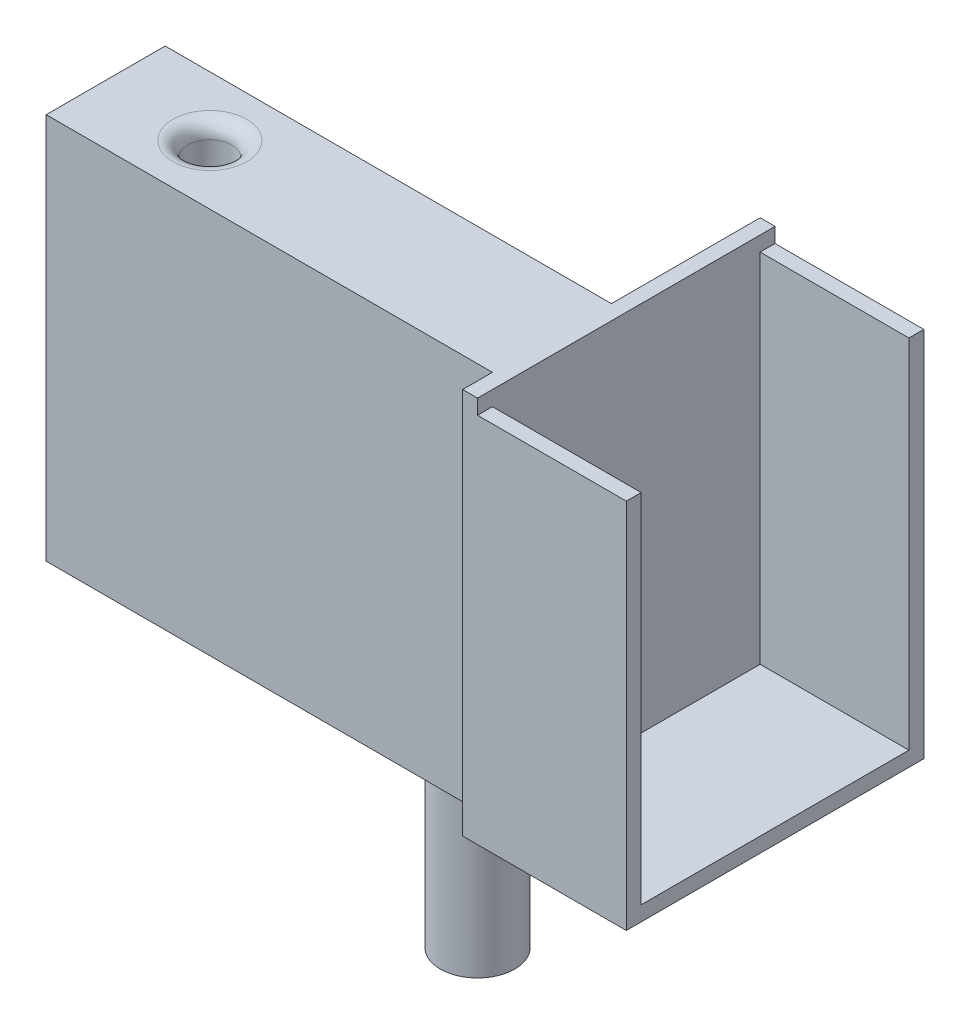
ISO-10303-21;
HEADER;
FILE_DESCRIPTION(('STEP AP214'),'2;1');
FILE_NAME('part.step','',(''),(''),'','','');
FILE_SCHEMA(('AUTOMOTIVE_DESIGN { 1 0 10303 214 1 1 1 1 }'));
ENDSEC;
DATA;
#1=APPLICATION_CONTEXT('core data for automotive mechanical design processes');
#2=APPLICATION_PROTOCOL_DEFINITION('international standard','automotive_design',2000,#1);
#3=PRODUCT_CONTEXT('',#1,'mechanical');
#4=PRODUCT('Part','Part','',(#3));
#5=PRODUCT_RELATED_PRODUCT_CATEGORY('part','',(#4));
#6=PRODUCT_DEFINITION_FORMATION('','',#4);
#7=PRODUCT_DEFINITION_CONTEXT('part definition',#1,'design');
#8=PRODUCT_DEFINITION('design','',#6,#7);
#9=PRODUCT_DEFINITION_SHAPE('','',#8);
#10=(LENGTH_UNIT() NAMED_UNIT(*) SI_UNIT(.MILLI.,.METRE.));
#11=(NAMED_UNIT(*) PLANE_ANGLE_UNIT() SI_UNIT($,.RADIAN.));
#12=(NAMED_UNIT(*) SI_UNIT($,.STERADIAN.) SOLID_ANGLE_UNIT());
#13=UNCERTAINTY_MEASURE_WITH_UNIT(LENGTH_MEASURE(1.E-05),#10,'distance_accuracy_value','');
#14=(GEOMETRIC_REPRESENTATION_CONTEXT(3) GLOBAL_UNCERTAINTY_ASSIGNED_CONTEXT((#13)) GLOBAL_UNIT_ASSIGNED_CONTEXT((#10,
#11,#12)) REPRESENTATION_CONTEXT('',''));
#15=CARTESIAN_POINT('',(0.,0.,0.));
#16=DIRECTION('',(0.,0.,1.));
#17=DIRECTION('',(1.,0.,0.));
#18=AXIS2_PLACEMENT_3D('',#15,#16,#17);
#19=CARTESIAN_POINT('',(0.,0.,20.32));
#20=DIRECTION('',(0.,1.,0.));
#21=DIRECTION('',(0.,0.,1.));
#22=AXIS2_PLACEMENT_3D('',#19,#20,#21);
#23=PLANE('',#22);
#24=DIRECTION('',(1.,0.,0.));
#25=VECTOR('',#24,1.);
#26=CARTESIAN_POINT('',(0.,0.,0.));
#27=LINE('',#26,#25);
#28=CARTESIAN_POINT('',(0.,0.,0.));
#29=VERTEX_POINT('',#28);
#30=CARTESIAN_POINT('',(76.2,0.,0.));
#31=VERTEX_POINT('',#30);
#32=EDGE_CURVE('E398',#29,#31,#27,.T.);
#33=ORIENTED_EDGE('',*,*,#32,.T.);
#34=DIRECTION('',(0.,0.,-1.));
#35=VECTOR('',#34,1.);
#36=CARTESIAN_POINT('',(76.2,0.,25.4));
#37=LINE('',#36,#35);
#38=CARTESIAN_POINT('',(76.2,0.,-25.4));
#39=VERTEX_POINT('',#38);
#40=EDGE_CURVE('E313',#31,#39,#37,.T.);
#41=ORIENTED_EDGE('',*,*,#40,.T.);
#42=DIRECTION('',(-1.,0.,0.));
#43=VECTOR('',#42,1.);
#44=CARTESIAN_POINT('',(78.74,0.,-25.4));
#45=LINE('',#44,#43);
#46=CARTESIAN_POINT('',(104.14,0.,-25.4));
#47=VERTEX_POINT('',#46);
#48=EDGE_CURVE('E340',#47,#39,#45,.T.);
#49=ORIENTED_EDGE('',*,*,#48,.F.);
#50=DIRECTION('',(0.,0.,-1.));
#51=VECTOR('',#50,1.);
#52=CARTESIAN_POINT('',(104.14,0.,25.4));
#53=LINE('',#52,#51);
#54=CARTESIAN_POINT('',(104.14,0.,25.4));
#55=VERTEX_POINT('',#54);
#56=EDGE_CURVE('E234',#55,#47,#53,.T.);
#57=ORIENTED_EDGE('',*,*,#56,.F.);
#58=DIRECTION('',(-1.,0.,0.));
#59=VECTOR('',#58,1.);
#60=CARTESIAN_POINT('',(78.74,0.,25.4));
#61=LINE('',#60,#59);
#62=CARTESIAN_POINT('',(76.2,0.,25.4));
#63=VERTEX_POINT('',#62);
#64=EDGE_CURVE('E342',#55,#63,#61,.T.);
#65=ORIENTED_EDGE('',*,*,#64,.T.);
#66=CARTESIAN_POINT('',(76.2,0.,20.32));
#67=VERTEX_POINT('',#66);
#68=EDGE_CURVE('E317',#63,#67,#37,.T.);
#69=ORIENTED_EDGE('',*,*,#68,.T.);
#70=DIRECTION('',(1.,0.,0.));
#71=VECTOR('',#70,1.);
#72=CARTESIAN_POINT('',(0.,0.,20.32));
#73=LINE('',#72,#71);
#74=CARTESIAN_POINT('',(0.,0.,20.32));
#75=VERTEX_POINT('',#74);
#76=EDGE_CURVE('E378',#75,#67,#73,.T.);
#77=ORIENTED_EDGE('',*,*,#76,.F.);
#78=DIRECTION('',(0.,0.,-1.));
#79=VECTOR('',#78,1.);
#80=CARTESIAN_POINT('',(0.,0.,20.32));
#81=LINE('',#80,#79);
#82=EDGE_CURVE('E408',#75,#29,#81,.T.);
#83=ORIENTED_EDGE('',*,*,#82,.T.);
#84=EDGE_LOOP('',(#33,#41,#49,#57,#65,#69,#77,#83));
#85=FACE_BOUND('',#84,.T.);
#86=DIRECTION('',(1.,0.,0.));
#87=VECTOR('',#86,1.);
#88=CARTESIAN_POINT('',(6.16,0.,6.16));
#89=LINE('',#88,#87);
#90=CARTESIAN_POINT('',(6.16,0.,6.16));
#91=VERTEX_POINT('',#90);
#92=CARTESIAN_POINT('',(14.16,0.,6.16));
#93=VERTEX_POINT('',#92);
#94=EDGE_CURVE('E347',#91,#93,#89,.T.);
#95=ORIENTED_EDGE('',*,*,#94,.F.);
#96=DIRECTION('',(0.,0.,-1.));
#97=VECTOR('',#96,1.);
#98=CARTESIAN_POINT('',(6.16,0.,14.16));
#99=LINE('',#98,#97);
#100=CARTESIAN_POINT('',(6.16,0.,14.16));
#101=VERTEX_POINT('',#100);
#102=EDGE_CURVE('E344',#101,#91,#99,.T.);
#103=ORIENTED_EDGE('',*,*,#102,.F.);
#104=DIRECTION('',(1.,0.,0.));
#105=VECTOR('',#104,1.);
#106=CARTESIAN_POINT('',(6.16,0.,14.16));
#107=LINE('',#106,#105);
#108=CARTESIAN_POINT('',(14.16,0.,14.16));
#109=VERTEX_POINT('',#108);
#110=EDGE_CURVE('E362',#101,#109,#107,.T.);
#111=ORIENTED_EDGE('',*,*,#110,.T.);
#112=DIRECTION('',(0.,0.,-1.));
#113=VECTOR('',#112,1.);
#114=CARTESIAN_POINT('',(14.16,0.,14.16));
#115=LINE('',#114,#113);
#116=EDGE_CURVE('E354',#109,#93,#115,.T.);
#117=ORIENTED_EDGE('',*,*,#116,.T.);
#118=EDGE_LOOP('',(#95,#103,#111,#117));
#119=FACE_BOUND('',#118,.T.);
#120=CARTESIAN_POINT('',(63.5,0.,10.16));
#121=DIRECTION('',(0.,1.,0.));
#122=DIRECTION('',(0.,0.,1.));
#123=AXIS2_PLACEMENT_3D('',#120,#121,#122);
#124=CIRCLE('',#123,6.35);
#125=CARTESIAN_POINT('',(63.5,0.,16.51));
#126=VERTEX_POINT('',#125);
#127=EDGE_CURVE('E11',#126,#126,#124,.F.);
#128=ORIENTED_EDGE('',*,*,#127,.F.);
#129=EDGE_LOOP('',(#128));
#130=FACE_BOUND('',#129,.T.);
#131=ADVANCED_FACE('F33',(#85,#119,#130),#23,.F.);
#132=CARTESIAN_POINT('',(17.78,8.89,10.16));
#133=DIRECTION('',(0.,1.,0.));
#134=DIRECTION('',(0.,0.,1.));
#135=AXIS2_PLACEMENT_3D('',#132,#133,#134);
#136=CYLINDRICAL_SURFACE('',#135,3.74999999299999);
#137=CARTESIAN_POINT('',(17.78,63.5,10.16));
#138=DIRECTION('',(0.,-1.,0.));
#139=DIRECTION('',(0.,0.,-1.));
#140=AXIS2_PLACEMENT_3D('',#137,#138,#139);
#141=CIRCLE('',#140,3.74999999299999);
#142=CARTESIAN_POINT('',(17.78,63.5,6.410000007));
#143=VERTEX_POINT('',#142);
#144=EDGE_CURVE('E410',#143,#143,#141,.F.);
#145=ORIENTED_EDGE('',*,*,#144,.T.);
#146=EDGE_LOOP('',(#145));
#147=FACE_BOUND('',#146,.T.);
#148=CARTESIAN_POINT('',(17.78,12.08,10.16));
#149=DIRECTION('',(0.,-1.,0.));
#150=DIRECTION('',(0.,0.,-1.));
#151=AXIS2_PLACEMENT_3D('',#148,#149,#150);
#152=CIRCLE('',#151,3.74999999299999);
#153=CARTESIAN_POINT('',(17.78,12.08,6.410000007));
#154=VERTEX_POINT('',#153);
#155=EDGE_CURVE('E227',#154,#154,#152,.F.);
#156=ORIENTED_EDGE('',*,*,#155,.F.);
#157=EDGE_LOOP('',(#156));
#158=FACE_BOUND('',#157,.T.);
#159=ADVANCED_FACE('F436',(#147,#158),#136,.F.);
#160=CARTESIAN_POINT('',(78.74,0.,0.));
#161=DIRECTION('',(1.,0.,0.));
#162=DIRECTION('',(0.,0.,-1.));
#163=AXIS2_PLACEMENT_3D('',#160,#161,#162);
#164=PLANE('',#163);
#165=DIRECTION('',(0.,0.,1.));
#166=VECTOR('',#165,1.);
#167=CARTESIAN_POINT('',(78.74,63.5,25.4));
#168=LINE('',#167,#166);
#169=CARTESIAN_POINT('',(78.74,63.5,22.86));
#170=VERTEX_POINT('',#169);
#171=CARTESIAN_POINT('',(78.74,63.5,25.4));
#172=VERTEX_POINT('',#171);
#173=EDGE_CURVE('E56',#170,#172,#168,.T.);
#174=ORIENTED_EDGE('',*,*,#173,.F.);
#175=DIRECTION('',(0.,1.,0.));
#176=VECTOR('',#175,1.);
#177=CARTESIAN_POINT('',(78.74,2.53999999999999,22.86));
#178=LINE('',#177,#176);
#179=CARTESIAN_POINT('',(78.74,2.53999999999999,22.86));
#180=VERTEX_POINT('',#179);
#181=EDGE_CURVE('E256',#180,#170,#178,.T.);
#182=ORIENTED_EDGE('',*,*,#181,.F.);
#183=DIRECTION('',(0.,0.,1.));
#184=VECTOR('',#183,1.);
#185=CARTESIAN_POINT('',(78.74,2.53999999999999,22.86));
#186=LINE('',#185,#184);
#187=CARTESIAN_POINT('',(78.74,2.53999999999999,-22.86));
#188=VERTEX_POINT('',#187);
#189=EDGE_CURVE('E253',#188,#180,#186,.T.);
#190=ORIENTED_EDGE('',*,*,#189,.F.);
#191=DIRECTION('',(0.,-1.,0.));
#192=VECTOR('',#191,1.);
#193=CARTESIAN_POINT('',(78.74,2.53999999999999,-22.86));
#194=LINE('',#193,#192);
#195=CARTESIAN_POINT('',(78.74,63.5,-22.86));
#196=VERTEX_POINT('',#195);
#197=EDGE_CURVE('E250',#196,#188,#194,.T.);
#198=ORIENTED_EDGE('',*,*,#197,.F.);
#199=DIRECTION('',(0.,0.,1.));
#200=VECTOR('',#199,1.);
#201=CARTESIAN_POINT('',(78.74,63.5,-25.4));
#202=LINE('',#201,#200);
#203=CARTESIAN_POINT('',(78.74,63.5,-25.4));
#204=VERTEX_POINT('',#203);
#205=EDGE_CURVE('E230',#204,#196,#202,.T.);
#206=ORIENTED_EDGE('',*,*,#205,.F.);
#207=DIRECTION('',(0.,1.,0.));
#208=VECTOR('',#207,1.);
#209=CARTESIAN_POINT('',(78.74,66.04,-25.4));
#210=LINE('',#209,#208);
#211=CARTESIAN_POINT('',(78.74,66.04,-25.4));
#212=VERTEX_POINT('',#211);
#213=EDGE_CURVE('E298',#204,#212,#210,.T.);
#214=ORIENTED_EDGE('',*,*,#213,.T.);
#215=DIRECTION('',(0.,0.,1.));
#216=VECTOR('',#215,1.);
#217=CARTESIAN_POINT('',(78.74,66.04,25.4));
#218=LINE('',#217,#216);
#219=CARTESIAN_POINT('',(78.74,66.04,25.4));
#220=VERTEX_POINT('',#219);
#221=EDGE_CURVE('E303',#212,#220,#218,.T.);
#222=ORIENTED_EDGE('',*,*,#221,.T.);
#223=DIRECTION('',(0.,-1.,0.));
#224=VECTOR('',#223,1.);
#225=CARTESIAN_POINT('',(78.74,66.04,25.4));
#226=LINE('',#225,#224);
#227=EDGE_CURVE('E295',#220,#172,#226,.T.);
#228=ORIENTED_EDGE('',*,*,#227,.T.);
#229=EDGE_LOOP('',(#174,#182,#190,#198,#206,#214,#222,#228));
#230=FACE_BOUND('',#229,.T.);
#231=DIRECTION('',(0.,0.,1.));
#232=VECTOR('',#231,1.);
#233=CARTESIAN_POINT('',(78.74,12.08,3.16));
#234=LINE('',#233,#232);
#235=CARTESIAN_POINT('',(78.74,12.08,3.16));
#236=VERTEX_POINT('',#235);
#237=CARTESIAN_POINT('',(78.74,12.08,17.16));
#238=VERTEX_POINT('',#237);
#239=EDGE_CURVE('E218',#236,#238,#234,.T.);
#240=ORIENTED_EDGE('',*,*,#239,.F.);
#241=DIRECTION('',(0.,1.,0.));
#242=VECTOR('',#241,1.);
#243=CARTESIAN_POINT('',(78.74,5.08000000000001,3.16));
#244=LINE('',#243,#242);
#245=CARTESIAN_POINT('',(78.74,5.08000000000001,3.16));
#246=VERTEX_POINT('',#245);
#247=EDGE_CURVE('E189',#246,#236,#244,.T.);
#248=ORIENTED_EDGE('',*,*,#247,.F.);
#249=DIRECTION('',(0.,0.,1.));
#250=VECTOR('',#249,1.);
#251=CARTESIAN_POINT('',(78.74,5.08000000000001,3.16));
#252=LINE('',#251,#250);
#253=CARTESIAN_POINT('',(78.74,5.08000000000001,17.16));
#254=VERTEX_POINT('',#253);
#255=EDGE_CURVE('E192',#246,#254,#252,.T.);
#256=ORIENTED_EDGE('',*,*,#255,.T.);
#257=DIRECTION('',(0.,1.,0.));
#258=VECTOR('',#257,1.);
#259=CARTESIAN_POINT('',(78.74,5.08000000000001,17.16));
#260=LINE('',#259,#258);
#261=EDGE_CURVE('E215',#254,#238,#260,.T.);
#262=ORIENTED_EDGE('',*,*,#261,.T.);
#263=EDGE_LOOP('',(#240,#248,#256,#262));
#264=FACE_BOUND('',#263,.T.);
#265=ADVANCED_FACE('F441',(#230,#264),#164,.T.);
#266=CARTESIAN_POINT('',(0.,0.,20.32));
#267=DIRECTION('',(1.,0.,0.));
#268=DIRECTION('',(0.,0.,-1.));
#269=AXIS2_PLACEMENT_3D('',#266,#267,#268);
#270=PLANE('',#269);
#271=DIRECTION('',(0.,-1.,0.));
#272=VECTOR('',#271,1.);
#273=CARTESIAN_POINT('',(0.,0.,0.));
#274=LINE('',#273,#272);
#275=CARTESIAN_POINT('',(0.,66.04,0.));
#276=VERTEX_POINT('',#275);
#277=EDGE_CURVE('E368',#276,#29,#274,.T.);
#278=ORIENTED_EDGE('',*,*,#277,.T.);
#279=ORIENTED_EDGE('',*,*,#82,.F.);
#280=DIRECTION('',(0.,-1.,0.));
#281=VECTOR('',#280,1.);
#282=CARTESIAN_POINT('',(0.,0.,20.32));
#283=LINE('',#282,#281);
#284=CARTESIAN_POINT('',(0.,66.04,20.32));
#285=VERTEX_POINT('',#284);
#286=EDGE_CURVE('E375',#285,#75,#283,.T.);
#287=ORIENTED_EDGE('',*,*,#286,.F.);
#288=DIRECTION('',(0.,0.,-1.));
#289=VECTOR('',#288,1.);
#290=CARTESIAN_POINT('',(0.,66.04,20.32));
#291=LINE('',#290,#289);
#292=EDGE_CURVE('E391',#285,#276,#291,.T.);
#293=ORIENTED_EDGE('',*,*,#292,.T.);
#294=EDGE_LOOP('',(#278,#279,#287,#293));
#295=FACE_BOUND('',#294,.T.);
#296=ADVANCED_FACE('F446',(#295),#270,.F.);
#297=CARTESIAN_POINT('',(0.,66.04,20.32));
#298=DIRECTION('',(0.,-1.,0.));
#299=DIRECTION('',(0.,0.,-1.));
#300=AXIS2_PLACEMENT_3D('',#297,#298,#299);
#301=PLANE('',#300);
#302=CARTESIAN_POINT('',(17.78,66.04,10.16));
#303=DIRECTION('',(0.,-1.,0.));
#304=DIRECTION('',(0.,0.,-1.));
#305=AXIS2_PLACEMENT_3D('',#302,#303,#304);
#306=CIRCLE('',#305,6.28999999299999);
#307=CARTESIAN_POINT('',(17.78,66.04,3.87000000700001));
#308=VERTEX_POINT('',#307);
#309=EDGE_CURVE('E41',#308,#308,#306,.T.);
#310=ORIENTED_EDGE('',*,*,#309,.T.);
#311=EDGE_LOOP('',(#310));
#312=FACE_BOUND('',#311,.T.);
#313=DIRECTION('',(-1.,0.,0.));
#314=VECTOR('',#313,1.);
#315=CARTESIAN_POINT('',(0.,66.04,0.));
#316=LINE('',#315,#314);
#317=CARTESIAN_POINT('',(76.2,66.04,0.));
#318=VERTEX_POINT('',#317);
#319=EDGE_CURVE('E379',#318,#276,#316,.T.);
#320=ORIENTED_EDGE('',*,*,#319,.T.);
#321=ORIENTED_EDGE('',*,*,#292,.F.);
#322=DIRECTION('',(-1.,0.,0.));
#323=VECTOR('',#322,1.);
#324=CARTESIAN_POINT('',(0.,66.04,20.32));
#325=LINE('',#324,#323);
#326=CARTESIAN_POINT('',(76.2,66.04,20.32));
#327=VERTEX_POINT('',#326);
#328=EDGE_CURVE('E388',#327,#285,#325,.T.);
#329=ORIENTED_EDGE('',*,*,#328,.F.);
#330=DIRECTION('',(0.,0.,1.));
#331=VECTOR('',#330,1.);
#332=CARTESIAN_POINT('',(76.2,66.04,25.4));
#333=LINE('',#332,#331);
#334=CARTESIAN_POINT('',(76.2,66.04,25.4));
#335=VERTEX_POINT('',#334);
#336=EDGE_CURVE('E329',#327,#335,#333,.T.);
#337=ORIENTED_EDGE('',*,*,#336,.T.);
#338=DIRECTION('',(-1.,0.,0.));
#339=VECTOR('',#338,1.);
#340=CARTESIAN_POINT('',(78.74,66.04,25.4));
#341=LINE('',#340,#339);
#342=EDGE_CURVE('E334',#220,#335,#341,.T.);
#343=ORIENTED_EDGE('',*,*,#342,.F.);
#344=ORIENTED_EDGE('',*,*,#221,.F.);
#345=DIRECTION('',(-1.,0.,0.));
#346=VECTOR('',#345,1.);
#347=CARTESIAN_POINT('',(78.74,66.04,-25.4));
#348=LINE('',#347,#346);
#349=CARTESIAN_POINT('',(76.2,66.04,-25.4));
#350=VERTEX_POINT('',#349);
#351=EDGE_CURVE('E337',#212,#350,#348,.T.);
#352=ORIENTED_EDGE('',*,*,#351,.T.);
#353=EDGE_CURVE('E299',#350,#318,#333,.T.);
#354=ORIENTED_EDGE('',*,*,#353,.T.);
#355=EDGE_LOOP('',(#320,#321,#329,#337,#343,#344,#352,#354));
#356=FACE_BOUND('',#355,.T.);
#357=ADVANCED_FACE('F417',(#312,#356),#301,.F.);
#358=CARTESIAN_POINT('',(0.,0.,20.32));
#359=DIRECTION('',(0.,0.,-1.));
#360=DIRECTION('',(-1.,0.,0.));
#361=AXIS2_PLACEMENT_3D('',#358,#359,#360);
#362=PLANE('',#361);
#363=ORIENTED_EDGE('',*,*,#286,.T.);
#364=ORIENTED_EDGE('',*,*,#76,.T.);
#365=DIRECTION('',(0.,1.,0.));
#366=VECTOR('',#365,1.);
#367=CARTESIAN_POINT('',(76.2,0.,20.32));
#368=LINE('',#367,#366);
#369=EDGE_CURVE('E384',#67,#327,#368,.T.);
#370=ORIENTED_EDGE('',*,*,#369,.T.);
#371=ORIENTED_EDGE('',*,*,#328,.T.);
#372=EDGE_LOOP('',(#363,#364,#370,#371));
#373=FACE_BOUND('',#372,.T.);
#374=ADVANCED_FACE('F453',(#373),#362,.F.);
#375=CARTESIAN_POINT('',(0.,0.,0.));
#376=DIRECTION('',(0.,0.,-1.));
#377=DIRECTION('',(-1.,0.,0.));
#378=AXIS2_PLACEMENT_3D('',#375,#376,#377);
#379=PLANE('',#378);
#380=ORIENTED_EDGE('',*,*,#277,.F.);
#381=ORIENTED_EDGE('',*,*,#319,.F.);
#382=DIRECTION('',(0.,1.,0.));
#383=VECTOR('',#382,1.);
#384=CARTESIAN_POINT('',(76.2,0.,0.));
#385=LINE('',#384,#383);
#386=EDGE_CURVE('E401',#31,#318,#385,.T.);
#387=ORIENTED_EDGE('',*,*,#386,.F.);
#388=ORIENTED_EDGE('',*,*,#32,.F.);
#389=EDGE_LOOP('',(#380,#381,#387,#388));
#390=FACE_BOUND('',#389,.T.);
#391=ADVANCED_FACE('F462',(#390),#379,.T.);
#392=CARTESIAN_POINT('',(6.16,5.08,14.16));
#393=DIRECTION('',(-1.,0.,0.));
#394=DIRECTION('',(0.,0.,1.));
#395=AXIS2_PLACEMENT_3D('',#392,#393,#394);
#396=PLANE('',#395);
#397=ORIENTED_EDGE('',*,*,#102,.T.);
#398=DIRECTION('',(0.,-1.,0.));
#399=VECTOR('',#398,1.);
#400=CARTESIAN_POINT('',(6.16,5.08,6.16));
#401=LINE('',#400,#399);
#402=CARTESIAN_POINT('',(6.16,5.08,6.16));
#403=VERTEX_POINT('',#402);
#404=EDGE_CURVE('E373',#403,#91,#401,.T.);
#405=ORIENTED_EDGE('',*,*,#404,.F.);
#406=DIRECTION('',(0.,0.,-1.));
#407=VECTOR('',#406,1.);
#408=CARTESIAN_POINT('',(6.16,5.08,14.16));
#409=LINE('',#408,#407);
#410=CARTESIAN_POINT('',(6.16,5.08000000000001,14.16));
#411=VERTEX_POINT('',#410);
#412=EDGE_CURVE('E365',#411,#403,#409,.T.);
#413=ORIENTED_EDGE('',*,*,#412,.F.);
#414=DIRECTION('',(0.,-1.,0.));
#415=VECTOR('',#414,1.);
#416=CARTESIAN_POINT('',(6.16,5.08,14.16));
#417=LINE('',#416,#415);
#418=EDGE_CURVE('E366',#411,#101,#417,.T.);
#419=ORIENTED_EDGE('',*,*,#418,.T.);
#420=EDGE_LOOP('',(#397,#405,#413,#419));
#421=FACE_BOUND('',#420,.T.);
#422=ADVANCED_FACE('F488',(#421),#396,.F.);
#423=CARTESIAN_POINT('',(6.16,5.08,14.16));
#424=DIRECTION('',(0.,0.,-1.));
#425=DIRECTION('',(-1.,0.,0.));
#426=AXIS2_PLACEMENT_3D('',#423,#424,#425);
#427=PLANE('',#426);
#428=ORIENTED_EDGE('',*,*,#110,.F.);
#429=ORIENTED_EDGE('',*,*,#418,.F.);
#430=DIRECTION('',(1.,0.,0.));
#431=VECTOR('',#430,1.);
#432=CARTESIAN_POINT('',(6.16,5.08,14.16));
#433=LINE('',#432,#431);
#434=CARTESIAN_POINT('',(14.16,5.08000000000001,14.16));
#435=VERTEX_POINT('',#434);
#436=EDGE_CURVE('E357',#411,#435,#433,.T.);
#437=ORIENTED_EDGE('',*,*,#436,.T.);
#438=DIRECTION('',(0.,-1.,0.));
#439=VECTOR('',#438,1.);
#440=CARTESIAN_POINT('',(14.16,5.08,14.16));
#441=LINE('',#440,#439);
#442=EDGE_CURVE('E369',#435,#109,#441,.T.);
#443=ORIENTED_EDGE('',*,*,#442,.T.);
#444=EDGE_LOOP('',(#428,#429,#437,#443));
#445=FACE_BOUND('',#444,.T.);
#446=ADVANCED_FACE('F485',(#445),#427,.T.);
#447=CARTESIAN_POINT('',(14.16,5.08,14.16));
#448=DIRECTION('',(-1.,0.,0.));
#449=DIRECTION('',(0.,0.,1.));
#450=AXIS2_PLACEMENT_3D('',#447,#448,#449);
#451=PLANE('',#450);
#452=ORIENTED_EDGE('',*,*,#116,.F.);
#453=ORIENTED_EDGE('',*,*,#442,.F.);
#454=DIRECTION('',(0.,0.,-1.));
#455=VECTOR('',#454,1.);
#456=CARTESIAN_POINT('',(14.16,5.08,14.16));
#457=LINE('',#456,#455);
#458=CARTESIAN_POINT('',(14.16,5.08000000000001,6.16));
#459=VERTEX_POINT('',#458);
#460=EDGE_CURVE('E626',#435,#459,#457,.T.);
#461=ORIENTED_EDGE('',*,*,#460,.T.);
#462=DIRECTION('',(0.,-1.,0.));
#463=VECTOR('',#462,1.);
#464=CARTESIAN_POINT('',(14.16,5.08,6.16));
#465=LINE('',#464,#463);
#466=EDGE_CURVE('E371',#459,#93,#465,.T.);
#467=ORIENTED_EDGE('',*,*,#466,.T.);
#468=EDGE_LOOP('',(#452,#453,#461,#467));
#469=FACE_BOUND('',#468,.T.);
#470=ADVANCED_FACE('F432',(#469),#451,.T.);
#471=CARTESIAN_POINT('',(6.16,5.08,6.16));
#472=DIRECTION('',(0.,0.,-1.));
#473=DIRECTION('',(-1.,0.,0.));
#474=AXIS2_PLACEMENT_3D('',#471,#472,#473);
#475=PLANE('',#474);
#476=ORIENTED_EDGE('',*,*,#94,.T.);
#477=ORIENTED_EDGE('',*,*,#466,.F.);
#478=DIRECTION('',(1.,0.,0.));
#479=VECTOR('',#478,1.);
#480=CARTESIAN_POINT('',(6.16,5.08,6.16));
#481=LINE('',#480,#479);
#482=EDGE_CURVE('E624',#403,#459,#481,.T.);
#483=ORIENTED_EDGE('',*,*,#482,.F.);
#484=ORIENTED_EDGE('',*,*,#404,.T.);
#485=EDGE_LOOP('',(#476,#477,#483,#484));
#486=FACE_BOUND('',#485,.T.);
#487=ADVANCED_FACE('F423',(#486),#475,.F.);
#488=CARTESIAN_POINT('',(17.78,63.5,10.16));
#489=DIRECTION('',(0.,-1.,0.));
#490=DIRECTION('',(0.,0.,-1.));
#491=AXIS2_PLACEMENT_3D('',#488,#489,#490);
#492=TOROIDAL_SURFACE('',#491,6.28999999299999,2.54);
#493=ORIENTED_EDGE('',*,*,#309,.F.);
#494=EDGE_LOOP('',(#493));
#495=FACE_BOUND('',#494,.T.);
#496=ORIENTED_EDGE('',*,*,#144,.F.);
#497=EDGE_LOOP('',(#496));
#498=FACE_BOUND('',#497,.T.);
#499=ADVANCED_FACE('F35',(#495,#498),#492,.T.);
#500=CARTESIAN_POINT('',(76.2,0.,0.));
#501=DIRECTION('',(1.,0.,0.));
#502=DIRECTION('',(0.,0.,-1.));
#503=AXIS2_PLACEMENT_3D('',#500,#501,#502);
#504=PLANE('',#503);
#505=ORIENTED_EDGE('',*,*,#40,.F.);
#506=ORIENTED_EDGE('',*,*,#386,.T.);
#507=ORIENTED_EDGE('',*,*,#353,.F.);
#508=DIRECTION('',(0.,1.,0.));
#509=VECTOR('',#508,1.);
#510=CARTESIAN_POINT('',(76.2,66.04,-25.4));
#511=LINE('',#510,#509);
#512=EDGE_CURVE('E322',#39,#350,#511,.T.);
#513=ORIENTED_EDGE('',*,*,#512,.F.);
#514=EDGE_LOOP('',(#505,#506,#507,#513));
#515=FACE_BOUND('',#514,.T.);
#516=ADVANCED_FACE('F422',(#515),#504,.F.);
#517=CARTESIAN_POINT('',(78.74,66.04,25.4));
#518=DIRECTION('',(0.,0.,-1.));
#519=DIRECTION('',(0.,1.,0.));
#520=AXIS2_PLACEMENT_3D('',#517,#518,#519);
#521=PLANE('',#520);
#522=DIRECTION('',(0.,-1.,0.));
#523=VECTOR('',#522,1.);
#524=CARTESIAN_POINT('',(76.2,66.04,25.4));
#525=LINE('',#524,#523);
#526=EDGE_CURVE('E308',#335,#63,#525,.T.);
#527=ORIENTED_EDGE('',*,*,#526,.T.);
#528=ORIENTED_EDGE('',*,*,#64,.F.);
#529=DIRECTION('',(0.,-1.,0.));
#530=VECTOR('',#529,1.);
#531=CARTESIAN_POINT('',(104.14,0.,25.4));
#532=LINE('',#531,#530);
#533=CARTESIAN_POINT('',(104.14,63.5,25.4));
#534=VERTEX_POINT('',#533);
#535=EDGE_CURVE('E231',#534,#55,#532,.T.);
#536=ORIENTED_EDGE('',*,*,#535,.F.);
#537=DIRECTION('',(-1.,0.,0.));
#538=VECTOR('',#537,1.);
#539=CARTESIAN_POINT('',(104.14,63.5,25.4));
#540=LINE('',#539,#538);
#541=EDGE_CURVE('E249',#534,#172,#540,.T.);
#542=ORIENTED_EDGE('',*,*,#541,.T.);
#543=ORIENTED_EDGE('',*,*,#227,.F.);
#544=ORIENTED_EDGE('',*,*,#342,.T.);
#545=EDGE_LOOP('',(#527,#528,#536,#542,#543,#544));
#546=FACE_BOUND('',#545,.T.);
#547=ADVANCED_FACE('F428',(#546),#521,.F.);
#548=CARTESIAN_POINT('',(78.74,66.04,-25.4));
#549=DIRECTION('',(0.,0.,1.));
#550=DIRECTION('',(0.,-1.,0.));
#551=AXIS2_PLACEMENT_3D('',#548,#549,#550);
#552=PLANE('',#551);
#553=ORIENTED_EDGE('',*,*,#512,.T.);
#554=ORIENTED_EDGE('',*,*,#351,.F.);
#555=ORIENTED_EDGE('',*,*,#213,.F.);
#556=DIRECTION('',(-1.,0.,0.));
#557=VECTOR('',#556,1.);
#558=CARTESIAN_POINT('',(104.14,63.5,-25.4));
#559=LINE('',#558,#557);
#560=CARTESIAN_POINT('',(104.14,63.5,-25.4));
#561=VERTEX_POINT('',#560);
#562=EDGE_CURVE('E289',#561,#204,#559,.T.);
#563=ORIENTED_EDGE('',*,*,#562,.F.);
#564=DIRECTION('',(0.,1.,0.));
#565=VECTOR('',#564,1.);
#566=CARTESIAN_POINT('',(104.14,0.,-25.4));
#567=LINE('',#566,#565);
#568=EDGE_CURVE('E237',#47,#561,#567,.T.);
#569=ORIENTED_EDGE('',*,*,#568,.F.);
#570=ORIENTED_EDGE('',*,*,#48,.T.);
#571=EDGE_LOOP('',(#553,#554,#555,#563,#569,#570));
#572=FACE_BOUND('',#571,.T.);
#573=ADVANCED_FACE('F473',(#572),#552,.F.);
#574=ORIENTED_EDGE('',*,*,#369,.F.);
#575=ORIENTED_EDGE('',*,*,#68,.F.);
#576=ORIENTED_EDGE('',*,*,#526,.F.);
#577=ORIENTED_EDGE('',*,*,#336,.F.);
#578=EDGE_LOOP('',(#574,#575,#576,#577));
#579=FACE_BOUND('',#578,.T.);
#580=ADVANCED_FACE('F431',(#579),#504,.F.);
#581=CARTESIAN_POINT('',(104.14,63.5,-25.4));
#582=DIRECTION('',(0.,-1.,0.));
#583=DIRECTION('',(0.,0.,-1.));
#584=AXIS2_PLACEMENT_3D('',#581,#582,#583);
#585=PLANE('',#584);
#586=ORIENTED_EDGE('',*,*,#205,.T.);
#587=DIRECTION('',(-1.,0.,0.));
#588=VECTOR('',#587,1.);
#589=CARTESIAN_POINT('',(104.14,63.5,-22.86));
#590=LINE('',#589,#588);
#591=CARTESIAN_POINT('',(104.14,63.5,-22.86));
#592=VERTEX_POINT('',#591);
#593=EDGE_CURVE('E284',#592,#196,#590,.T.);
#594=ORIENTED_EDGE('',*,*,#593,.F.);
#595=DIRECTION('',(0.,0.,1.));
#596=VECTOR('',#595,1.);
#597=CARTESIAN_POINT('',(104.14,63.5,-25.4));
#598=LINE('',#597,#596);
#599=EDGE_CURVE('E239',#561,#592,#598,.T.);
#600=ORIENTED_EDGE('',*,*,#599,.F.);
#601=ORIENTED_EDGE('',*,*,#562,.T.);
#602=EDGE_LOOP('',(#586,#594,#600,#601));
#603=FACE_BOUND('',#602,.T.);
#604=ADVANCED_FACE('F610',(#603),#585,.F.);
#605=CARTESIAN_POINT('',(104.14,2.53999999999999,-22.86));
#606=DIRECTION('',(0.,0.,-1.));
#607=DIRECTION('',(0.,1.,0.));
#608=AXIS2_PLACEMENT_3D('',#605,#606,#607);
#609=PLANE('',#608);
#610=ORIENTED_EDGE('',*,*,#197,.T.);
#611=DIRECTION('',(-1.,0.,0.));
#612=VECTOR('',#611,1.);
#613=CARTESIAN_POINT('',(104.14,2.53999999999999,-22.86));
#614=LINE('',#613,#612);
#615=CARTESIAN_POINT('',(104.14,2.53999999999999,-22.86));
#616=VERTEX_POINT('',#615);
#617=EDGE_CURVE('E279',#616,#188,#614,.T.);
#618=ORIENTED_EDGE('',*,*,#617,.F.);
#619=DIRECTION('',(0.,-1.,0.));
#620=VECTOR('',#619,1.);
#621=CARTESIAN_POINT('',(104.14,2.53999999999999,-22.86));
#622=LINE('',#621,#620);
#623=EDGE_CURVE('E241',#592,#616,#622,.T.);
#624=ORIENTED_EDGE('',*,*,#623,.F.);
#625=ORIENTED_EDGE('',*,*,#593,.T.);
#626=EDGE_LOOP('',(#610,#618,#624,#625));
#627=FACE_BOUND('',#626,.T.);
#628=ADVANCED_FACE('F606',(#627),#609,.F.);
#629=CARTESIAN_POINT('',(104.14,2.53999999999999,22.86));
#630=DIRECTION('',(0.,-1.,0.));
#631=DIRECTION('',(0.,0.,-1.));
#632=AXIS2_PLACEMENT_3D('',#629,#630,#631);
#633=PLANE('',#632);
#634=ORIENTED_EDGE('',*,*,#189,.T.);
#635=DIRECTION('',(-1.,0.,0.));
#636=VECTOR('',#635,1.);
#637=CARTESIAN_POINT('',(104.14,2.53999999999999,22.86));
#638=LINE('',#637,#636);
#639=CARTESIAN_POINT('',(104.14,2.53999999999999,22.86));
#640=VERTEX_POINT('',#639);
#641=EDGE_CURVE('E274',#640,#180,#638,.T.);
#642=ORIENTED_EDGE('',*,*,#641,.F.);
#643=DIRECTION('',(0.,0.,1.));
#644=VECTOR('',#643,1.);
#645=CARTESIAN_POINT('',(104.14,2.53999999999999,22.86));
#646=LINE('',#645,#644);
#647=EDGE_CURVE('E243',#616,#640,#646,.T.);
#648=ORIENTED_EDGE('',*,*,#647,.F.);
#649=ORIENTED_EDGE('',*,*,#617,.T.);
#650=EDGE_LOOP('',(#634,#642,#648,#649));
#651=FACE_BOUND('',#650,.T.);
#652=ADVANCED_FACE('F603',(#651),#633,.F.);
#653=CARTESIAN_POINT('',(104.14,2.53999999999999,22.86));
#654=DIRECTION('',(0.,0.,1.));
#655=DIRECTION('',(1.,0.,0.));
#656=AXIS2_PLACEMENT_3D('',#653,#654,#655);
#657=PLANE('',#656);
#658=ORIENTED_EDGE('',*,*,#181,.T.);
#659=DIRECTION('',(-1.,0.,0.));
#660=VECTOR('',#659,1.);
#661=CARTESIAN_POINT('',(104.14,63.5,22.86));
#662=LINE('',#661,#660);
#663=CARTESIAN_POINT('',(104.14,63.5,22.86));
#664=VERTEX_POINT('',#663);
#665=EDGE_CURVE('E260',#664,#170,#662,.T.);
#666=ORIENTED_EDGE('',*,*,#665,.F.);
#667=DIRECTION('',(0.,1.,0.));
#668=VECTOR('',#667,1.);
#669=CARTESIAN_POINT('',(104.14,2.53999999999999,22.86));
#670=LINE('',#669,#668);
#671=EDGE_CURVE('E245',#640,#664,#670,.T.);
#672=ORIENTED_EDGE('',*,*,#671,.F.);
#673=ORIENTED_EDGE('',*,*,#641,.T.);
#674=EDGE_LOOP('',(#658,#666,#672,#673));
#675=FACE_BOUND('',#674,.T.);
#676=ADVANCED_FACE('F600',(#675),#657,.F.);
#677=CARTESIAN_POINT('',(104.14,63.5,25.4));
#678=DIRECTION('',(0.,-1.,0.));
#679=DIRECTION('',(0.,0.,-1.));
#680=AXIS2_PLACEMENT_3D('',#677,#678,#679);
#681=PLANE('',#680);
#682=ORIENTED_EDGE('',*,*,#173,.T.);
#683=ORIENTED_EDGE('',*,*,#541,.F.);
#684=DIRECTION('',(0.,0.,1.));
#685=VECTOR('',#684,1.);
#686=CARTESIAN_POINT('',(104.14,63.5,25.4));
#687=LINE('',#686,#685);
#688=EDGE_CURVE('E247',#664,#534,#687,.T.);
#689=ORIENTED_EDGE('',*,*,#688,.F.);
#690=ORIENTED_EDGE('',*,*,#665,.T.);
#691=EDGE_LOOP('',(#682,#683,#689,#690));
#692=FACE_BOUND('',#691,.T.);
#693=ADVANCED_FACE('F597',(#692),#681,.F.);
#694=CARTESIAN_POINT('',(104.14,0.,0.));
#695=DIRECTION('',(-1.,0.,0.));
#696=DIRECTION('',(0.,0.,1.));
#697=AXIS2_PLACEMENT_3D('',#694,#695,#696);
#698=PLANE('',#697);
#699=ORIENTED_EDGE('',*,*,#535,.T.);
#700=ORIENTED_EDGE('',*,*,#56,.T.);
#701=ORIENTED_EDGE('',*,*,#568,.T.);
#702=ORIENTED_EDGE('',*,*,#599,.T.);
#703=ORIENTED_EDGE('',*,*,#623,.T.);
#704=ORIENTED_EDGE('',*,*,#647,.T.);
#705=ORIENTED_EDGE('',*,*,#671,.T.);
#706=ORIENTED_EDGE('',*,*,#688,.T.);
#707=EDGE_LOOP('',(#699,#700,#701,#702,#703,#704,#705,#706));
#708=FACE_BOUND('',#707,.T.);
#709=ADVANCED_FACE('F476',(#708),#698,.F.);
#710=CARTESIAN_POINT('',(104.141025,12.08,3.16));
#711=DIRECTION('',(0.,-1.,0.));
#712=DIRECTION('',(0.,0.,-1.));
#713=AXIS2_PLACEMENT_3D('',#710,#711,#712);
#714=PLANE('',#713);
#715=ORIENTED_EDGE('',*,*,#239,.T.);
#716=DIRECTION('',(-1.,0.,0.));
#717=VECTOR('',#716,1.);
#718=CARTESIAN_POINT('',(104.141025,12.08,17.16));
#719=LINE('',#718,#717);
#720=CARTESIAN_POINT('',(2.54,12.08,17.16));
#721=VERTEX_POINT('',#720);
#722=EDGE_CURVE('E193',#238,#721,#719,.T.);
#723=ORIENTED_EDGE('',*,*,#722,.T.);
#724=DIRECTION('',(0.,0.,1.));
#725=VECTOR('',#724,1.);
#726=CARTESIAN_POINT('',(2.54,12.08,3.16));
#727=LINE('',#726,#725);
#728=CARTESIAN_POINT('',(2.54,12.08,3.16));
#729=VERTEX_POINT('',#728);
#730=EDGE_CURVE('E196',#729,#721,#727,.T.);
#731=ORIENTED_EDGE('',*,*,#730,.F.);
#732=DIRECTION('',(-1.,0.,0.));
#733=VECTOR('',#732,1.);
#734=CARTESIAN_POINT('',(104.141025,12.08,3.16));
#735=LINE('',#734,#733);
#736=EDGE_CURVE('E182',#236,#729,#735,.T.);
#737=ORIENTED_EDGE('',*,*,#736,.F.);
#738=EDGE_LOOP('',(#715,#723,#731,#737));
#739=FACE_BOUND('',#738,.T.);
#740=ORIENTED_EDGE('',*,*,#155,.T.);
#741=EDGE_LOOP('',(#740));
#742=FACE_BOUND('',#741,.T.);
#743=ADVANCED_FACE('F197',(#739,#742),#714,.T.);
#744=CARTESIAN_POINT('',(104.141025,5.08000000000001,3.16));
#745=DIRECTION('',(0.,-1.,0.));
#746=DIRECTION('',(0.,0.,-1.));
#747=AXIS2_PLACEMENT_3D('',#744,#745,#746);
#748=PLANE('',#747);
#749=DIRECTION('',(-1.,0.,0.));
#750=VECTOR('',#749,1.);
#751=CARTESIAN_POINT('',(104.141025,5.08000000000001,3.16));
#752=LINE('',#751,#750);
#753=CARTESIAN_POINT('',(2.54,5.08000000000001,3.16));
#754=VERTEX_POINT('',#753);
#755=EDGE_CURVE('E221',#246,#754,#752,.T.);
#756=ORIENTED_EDGE('',*,*,#755,.T.);
#757=DIRECTION('',(0.,0.,1.));
#758=VECTOR('',#757,1.);
#759=CARTESIAN_POINT('',(2.54,5.08000000000001,3.16));
#760=LINE('',#759,#758);
#761=CARTESIAN_POINT('',(2.54,5.08000000000001,17.16));
#762=VERTEX_POINT('',#761);
#763=EDGE_CURVE('E207',#754,#762,#760,.T.);
#764=ORIENTED_EDGE('',*,*,#763,.T.);
#765=DIRECTION('',(-1.,0.,0.));
#766=VECTOR('',#765,1.);
#767=CARTESIAN_POINT('',(104.141025,5.08000000000001,17.16));
#768=LINE('',#767,#766);
#769=EDGE_CURVE('E48',#254,#762,#768,.T.);
#770=ORIENTED_EDGE('',*,*,#769,.F.);
#771=ORIENTED_EDGE('',*,*,#255,.F.);
#772=EDGE_LOOP('',(#756,#764,#770,#771));
#773=FACE_BOUND('',#772,.T.);
#774=ORIENTED_EDGE('',*,*,#482,.T.);
#775=ORIENTED_EDGE('',*,*,#460,.F.);
#776=ORIENTED_EDGE('',*,*,#436,.F.);
#777=ORIENTED_EDGE('',*,*,#412,.T.);
#778=EDGE_LOOP('',(#774,#775,#776,#777));
#779=FACE_BOUND('',#778,.T.);
#780=ADVANCED_FACE('F529',(#773,#779),#748,.F.);
#781=CARTESIAN_POINT('',(104.141025,5.08000000000001,3.16));
#782=DIRECTION('',(0.,0.,1.));
#783=DIRECTION('',(1.,0.,0.));
#784=AXIS2_PLACEMENT_3D('',#781,#782,#783);
#785=PLANE('',#784);
#786=ORIENTED_EDGE('',*,*,#247,.T.);
#787=ORIENTED_EDGE('',*,*,#736,.T.);
#788=DIRECTION('',(0.,1.,0.));
#789=VECTOR('',#788,1.);
#790=CARTESIAN_POINT('',(2.54,5.08000000000001,3.16));
#791=LINE('',#790,#789);
#792=EDGE_CURVE('E187',#754,#729,#791,.T.);
#793=ORIENTED_EDGE('',*,*,#792,.F.);
#794=ORIENTED_EDGE('',*,*,#755,.F.);
#795=EDGE_LOOP('',(#786,#787,#793,#794));
#796=FACE_BOUND('',#795,.T.);
#797=ADVANCED_FACE('F184',(#796),#785,.T.);
#798=CARTESIAN_POINT('',(104.141025,5.08000000000001,17.16));
#799=DIRECTION('',(0.,0.,1.));
#800=DIRECTION('',(1.,0.,0.));
#801=AXIS2_PLACEMENT_3D('',#798,#799,#800);
#802=PLANE('',#801);
#803=ORIENTED_EDGE('',*,*,#769,.T.);
#804=DIRECTION('',(0.,1.,0.));
#805=VECTOR('',#804,1.);
#806=CARTESIAN_POINT('',(2.54,5.08000000000001,17.16));
#807=LINE('',#806,#805);
#808=EDGE_CURVE('E203',#762,#721,#807,.T.);
#809=ORIENTED_EDGE('',*,*,#808,.T.);
#810=ORIENTED_EDGE('',*,*,#722,.F.);
#811=ORIENTED_EDGE('',*,*,#261,.F.);
#812=EDGE_LOOP('',(#803,#809,#810,#811));
#813=FACE_BOUND('',#812,.T.);
#814=ADVANCED_FACE('F548',(#813),#802,.F.);
#815=CARTESIAN_POINT('',(2.54,0.,0.));
#816=DIRECTION('',(1.,0.,0.));
#817=DIRECTION('',(0.,0.,-1.));
#818=AXIS2_PLACEMENT_3D('',#815,#816,#817);
#819=PLANE('',#818);
#820=ORIENTED_EDGE('',*,*,#792,.T.);
#821=ORIENTED_EDGE('',*,*,#730,.T.);
#822=ORIENTED_EDGE('',*,*,#808,.F.);
#823=ORIENTED_EDGE('',*,*,#763,.F.);
#824=EDGE_LOOP('',(#820,#821,#822,#823));
#825=FACE_BOUND('',#824,.T.);
#826=ADVANCED_FACE('F206',(#825),#819,.T.);
#827=CARTESIAN_POINT('',(63.5,-30.48,10.16));
#828=DIRECTION('',(0.,1.,0.));
#829=DIRECTION('',(0.,0.,1.));
#830=AXIS2_PLACEMENT_3D('',#827,#828,#829);
#831=CYLINDRICAL_SURFACE('',#830,6.35);
#832=CARTESIAN_POINT('',(63.5,-30.48,10.16));
#833=DIRECTION('',(0.,-1.,0.));
#834=DIRECTION('',(0.,0.,-1.));
#835=AXIS2_PLACEMENT_3D('',#832,#833,#834);
#836=CIRCLE('',#835,6.35);
#837=CARTESIAN_POINT('',(63.5,-30.48,3.81000000000001));
#838=VERTEX_POINT('',#837);
#839=EDGE_CURVE('E208',#838,#838,#836,.T.);
#840=ORIENTED_EDGE('',*,*,#839,.F.);
#841=EDGE_LOOP('',(#840));
#842=FACE_BOUND('',#841,.T.);
#843=ORIENTED_EDGE('',*,*,#127,.T.);
#844=EDGE_LOOP('',(#843));
#845=FACE_BOUND('',#844,.T.);
#846=ADVANCED_FACE('F565',(#842,#845),#831,.T.);
#847=CARTESIAN_POINT('',(63.5,-30.48,10.16));
#848=DIRECTION('',(0.,-1.,0.));
#849=DIRECTION('',(0.,0.,-1.));
#850=AXIS2_PLACEMENT_3D('',#847,#848,#849);
#851=PLANE('',#850);
#852=ORIENTED_EDGE('',*,*,#839,.T.);
#853=EDGE_LOOP('',(#852));
#854=FACE_BOUND('',#853,.T.);
#855=ADVANCED_FACE('F581',(#854),#851,.T.);
#856=CLOSED_SHELL('',(#131,#159,#265,#296,#357,#374,#391,#422,#446,#470,#487,#499,#516,#547,
#573,#580,#604,#628,#652,#676,#693,#709,#743,#780,#797,#814,#826,#846,#855));
#857=MANIFOLD_SOLID_BREP('B2',#856);
#858=ADVANCED_BREP_SHAPE_REPRESENTATION('',(#18,#857),#14);
#859=SHAPE_DEFINITION_REPRESENTATION(#9,#858);
ENDSEC;
END-ISO-10303-21;
